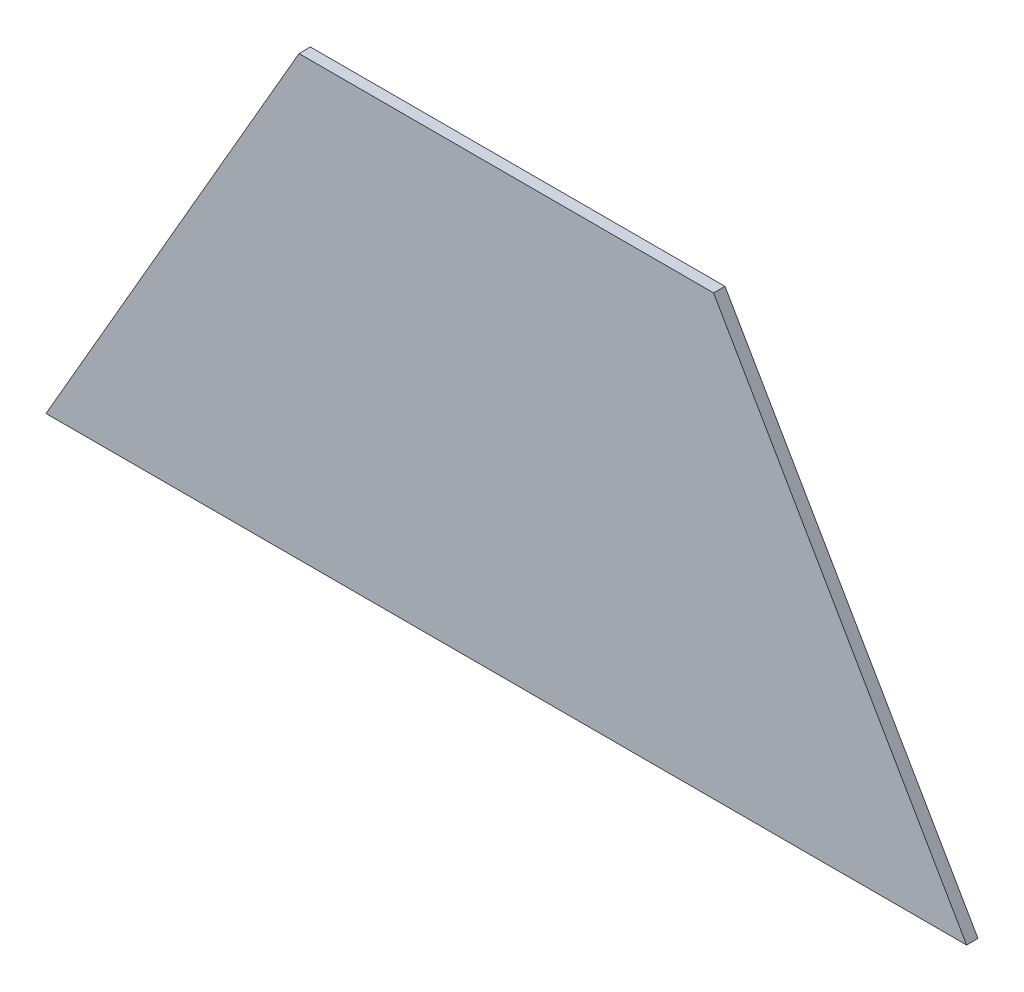
ISO-10303-21;
HEADER;
FILE_DESCRIPTION(('STEP AP214'),'2;1');
FILE_NAME('part.step','',(''),(''),'','','');
FILE_SCHEMA(('AUTOMOTIVE_DESIGN { 1 0 10303 214 1 1 1 1 }'));
ENDSEC;
DATA;
#1=APPLICATION_CONTEXT('core data for automotive mechanical design processes');
#2=APPLICATION_PROTOCOL_DEFINITION('international standard','automotive_design',2000,#1);
#3=PRODUCT_CONTEXT('',#1,'mechanical');
#4=PRODUCT('Part','Part','',(#3));
#5=PRODUCT_RELATED_PRODUCT_CATEGORY('part','',(#4));
#6=PRODUCT_DEFINITION_FORMATION('','',#4);
#7=PRODUCT_DEFINITION_CONTEXT('part definition',#1,'design');
#8=PRODUCT_DEFINITION('design','',#6,#7);
#9=PRODUCT_DEFINITION_SHAPE('','',#8);
#10=(LENGTH_UNIT() NAMED_UNIT(*) SI_UNIT(.MILLI.,.METRE.));
#11=(NAMED_UNIT(*) PLANE_ANGLE_UNIT() SI_UNIT($,.RADIAN.));
#12=(NAMED_UNIT(*) SI_UNIT($,.STERADIAN.) SOLID_ANGLE_UNIT());
#13=UNCERTAINTY_MEASURE_WITH_UNIT(LENGTH_MEASURE(1.E-05),#10,'distance_accuracy_value','');
#14=(GEOMETRIC_REPRESENTATION_CONTEXT(3) GLOBAL_UNCERTAINTY_ASSIGNED_CONTEXT((#13)) GLOBAL_UNIT_ASSIGNED_CONTEXT((#10,
#11,#12)) REPRESENTATION_CONTEXT('',''));
#15=CARTESIAN_POINT('',(0.,0.,0.));
#16=DIRECTION('',(0.,0.,1.));
#17=DIRECTION('',(1.,0.,0.));
#18=AXIS2_PLACEMENT_3D('',#15,#16,#17);
#19=CARTESIAN_POINT('',(-216.238948080691,-374.536844651005,-1075.58543644047));
#20=DIRECTION('',(-0.866025403784439,0.5,0.));
#21=DIRECTION('',(-0.5,-0.866025403784439,0.));
#22=AXIS2_PLACEMENT_3D('',#19,#20,#21);
#23=PLANE('',#22);
#24=DIRECTION('',(0.5,0.866025403784439,0.));
#25=VECTOR('',#24,1.);
#26=CARTESIAN_POINT('',(-216.238948080691,-374.536844651005,-11.90625));
#27=LINE('',#26,#25);
#28=CARTESIAN_POINT('',(-480.203491154188,-831.736844651005,-11.90625));
#29=VERTEX_POINT('',#28);
#30=CARTESIAN_POINT('',(-216.238948080691,-374.536844651005,-11.90625));
#31=VERTEX_POINT('',#30);
#32=EDGE_CURVE('E36',#29,#31,#27,.T.);
#33=ORIENTED_EDGE('',*,*,#32,.F.);
#34=DIRECTION('',(0.,0.,1.));
#35=VECTOR('',#34,1.);
#36=CARTESIAN_POINT('',(-480.203491154188,-831.736844651005,-1075.58543644047));
#37=LINE('',#36,#35);
#38=CARTESIAN_POINT('',(-480.203491154188,-831.736844651005,0.));
#39=VERTEX_POINT('',#38);
#40=EDGE_CURVE('E64',#29,#39,#37,.T.);
#41=ORIENTED_EDGE('',*,*,#40,.T.);
#42=DIRECTION('',(-0.5,-0.866025403784439,0.));
#43=VECTOR('',#42,1.);
#44=CARTESIAN_POINT('',(-216.238948080691,-374.536844651005,0.));
#45=LINE('',#44,#43);
#46=CARTESIAN_POINT('',(-216.238948080691,-374.536844651005,0.));
#47=VERTEX_POINT('',#46);
#48=EDGE_CURVE('E68',#47,#39,#45,.T.);
#49=ORIENTED_EDGE('',*,*,#48,.F.);
#50=DIRECTION('',(0.,0.,1.));
#51=VECTOR('',#50,1.);
#52=CARTESIAN_POINT('',(-216.238948080691,-374.536844651005,-1075.58543644047));
#53=LINE('',#52,#51);
#54=EDGE_CURVE('E91',#31,#47,#53,.T.);
#55=ORIENTED_EDGE('',*,*,#54,.F.);
#56=EDGE_LOOP('',(#33,#41,#49,#55));
#57=FACE_BOUND('',#56,.T.);
#58=ADVANCED_FACE('F28',(#57),#23,.T.);
#59=CARTESIAN_POINT('',(216.238948080681,-374.536844651005,-1075.58543644047));
#60=DIRECTION('',(0.,1.,0.));
#61=DIRECTION('',(-1.,0.,0.));
#62=AXIS2_PLACEMENT_3D('',#59,#60,#61);
#63=PLANE('',#62);
#64=DIRECTION('',(1.,0.,0.));
#65=VECTOR('',#64,1.);
#66=CARTESIAN_POINT('',(216.238948080681,-374.536844651005,-11.90625));
#67=LINE('',#66,#65);
#68=CARTESIAN_POINT('',(216.238948080681,-374.536844651005,-11.90625));
#69=VERTEX_POINT('',#68);
#70=EDGE_CURVE('E42',#31,#69,#67,.T.);
#71=ORIENTED_EDGE('',*,*,#70,.F.);
#72=ORIENTED_EDGE('',*,*,#54,.T.);
#73=DIRECTION('',(-1.,0.,0.));
#74=VECTOR('',#73,1.);
#75=CARTESIAN_POINT('',(216.238948080681,-374.536844651005,0.));
#76=LINE('',#75,#74);
#77=CARTESIAN_POINT('',(216.238948080681,-374.536844651005,0.));
#78=VERTEX_POINT('',#77);
#79=EDGE_CURVE('E73',#78,#47,#76,.T.);
#80=ORIENTED_EDGE('',*,*,#79,.F.);
#81=DIRECTION('',(0.,0.,1.));
#82=VECTOR('',#81,1.);
#83=CARTESIAN_POINT('',(216.238948080681,-374.536844651005,-1075.58543644047));
#84=LINE('',#83,#82);
#85=EDGE_CURVE('E94',#69,#78,#84,.T.);
#86=ORIENTED_EDGE('',*,*,#85,.F.);
#87=EDGE_LOOP('',(#71,#72,#80,#86));
#88=FACE_BOUND('',#87,.T.);
#89=ADVANCED_FACE('F100',(#88),#63,.T.);
#90=CARTESIAN_POINT('',(480.203491154177,-831.736844651005,-1075.58543644047));
#91=DIRECTION('',(0.866025403784439,0.5,0.));
#92=DIRECTION('',(-0.5,0.866025403784439,0.));
#93=AXIS2_PLACEMENT_3D('',#90,#91,#92);
#94=PLANE('',#93);
#95=DIRECTION('',(0.5,-0.866025403784439,0.));
#96=VECTOR('',#95,1.);
#97=CARTESIAN_POINT('',(480.203491154177,-831.736844651005,-11.90625));
#98=LINE('',#97,#96);
#99=CARTESIAN_POINT('',(480.203491154177,-831.736844651005,-11.90625));
#100=VERTEX_POINT('',#99);
#101=EDGE_CURVE('E93',#69,#100,#98,.T.);
#102=ORIENTED_EDGE('',*,*,#101,.F.);
#103=ORIENTED_EDGE('',*,*,#85,.T.);
#104=DIRECTION('',(-0.5,0.866025403784439,0.));
#105=VECTOR('',#104,1.);
#106=CARTESIAN_POINT('',(480.203491154177,-831.736844651005,0.));
#107=LINE('',#106,#105);
#108=CARTESIAN_POINT('',(480.203491154177,-831.736844651005,0.));
#109=VERTEX_POINT('',#108);
#110=EDGE_CURVE('E81',#109,#78,#107,.T.);
#111=ORIENTED_EDGE('',*,*,#110,.F.);
#112=DIRECTION('',(0.,0.,1.));
#113=VECTOR('',#112,1.);
#114=CARTESIAN_POINT('',(480.203491154177,-831.736844651005,-1075.58543644047));
#115=LINE('',#114,#113);
#116=EDGE_CURVE('E72',#100,#109,#115,.T.);
#117=ORIENTED_EDGE('',*,*,#116,.F.);
#118=EDGE_LOOP('',(#102,#103,#111,#117));
#119=FACE_BOUND('',#118,.T.);
#120=ADVANCED_FACE('F98',(#119),#94,.T.);
#121=CARTESIAN_POINT('',(-480.203491154188,-831.736844651005,-1075.58543644047));
#122=DIRECTION('',(0.,-1.,0.));
#123=DIRECTION('',(1.,0.,0.));
#124=AXIS2_PLACEMENT_3D('',#121,#122,#123);
#125=PLANE('',#124);
#126=DIRECTION('',(-1.,0.,0.));
#127=VECTOR('',#126,1.);
#128=CARTESIAN_POINT('',(-480.203491154188,-831.736844651005,-11.90625));
#129=LINE('',#128,#127);
#130=EDGE_CURVE('E11',#100,#29,#129,.T.);
#131=ORIENTED_EDGE('',*,*,#130,.F.);
#132=ORIENTED_EDGE('',*,*,#116,.T.);
#133=DIRECTION('',(1.,0.,0.));
#134=VECTOR('',#133,1.);
#135=CARTESIAN_POINT('',(-480.203491154188,-831.736844651005,0.));
#136=LINE('',#135,#134);
#137=EDGE_CURVE('E75',#39,#109,#136,.T.);
#138=ORIENTED_EDGE('',*,*,#137,.F.);
#139=ORIENTED_EDGE('',*,*,#40,.F.);
#140=EDGE_LOOP('',(#131,#132,#138,#139));
#141=FACE_BOUND('',#140,.T.);
#142=ADVANCED_FACE('F76',(#141),#125,.T.);
#143=CARTESIAN_POINT('',(0.,0.,0.));
#144=DIRECTION('',(0.,0.,1.));
#145=DIRECTION('',(1.,0.,0.));
#146=AXIS2_PLACEMENT_3D('',#143,#144,#145);
#147=PLANE('',#146);
#148=ORIENTED_EDGE('',*,*,#48,.T.);
#149=ORIENTED_EDGE('',*,*,#137,.T.);
#150=ORIENTED_EDGE('',*,*,#110,.T.);
#151=ORIENTED_EDGE('',*,*,#79,.T.);
#152=EDGE_LOOP('',(#148,#149,#150,#151));
#153=FACE_BOUND('',#152,.T.);
#154=ADVANCED_FACE('F83',(#153),#147,.T.);
#155=CARTESIAN_POINT('',(0.,0.,-11.90625));
#156=DIRECTION('',(0.,0.,1.));
#157=DIRECTION('',(0.,1.,0.));
#158=AXIS2_PLACEMENT_3D('',#155,#156,#157);
#159=PLANE('',#158);
#160=ORIENTED_EDGE('',*,*,#32,.T.);
#161=ORIENTED_EDGE('',*,*,#70,.T.);
#162=ORIENTED_EDGE('',*,*,#101,.T.);
#163=ORIENTED_EDGE('',*,*,#130,.T.);
#164=EDGE_LOOP('',(#160,#161,#162,#163));
#165=FACE_BOUND('',#164,.T.);
#166=ADVANCED_FACE('F102',(#165),#159,.F.);
#167=CLOSED_SHELL('',(#58,#89,#120,#142,#154,#166));
#168=MANIFOLD_SOLID_BREP('B2',#167);
#169=ADVANCED_BREP_SHAPE_REPRESENTATION('',(#18,#168),#14);
#170=SHAPE_DEFINITION_REPRESENTATION(#9,#169);
ENDSEC;
END-ISO-10303-21;
